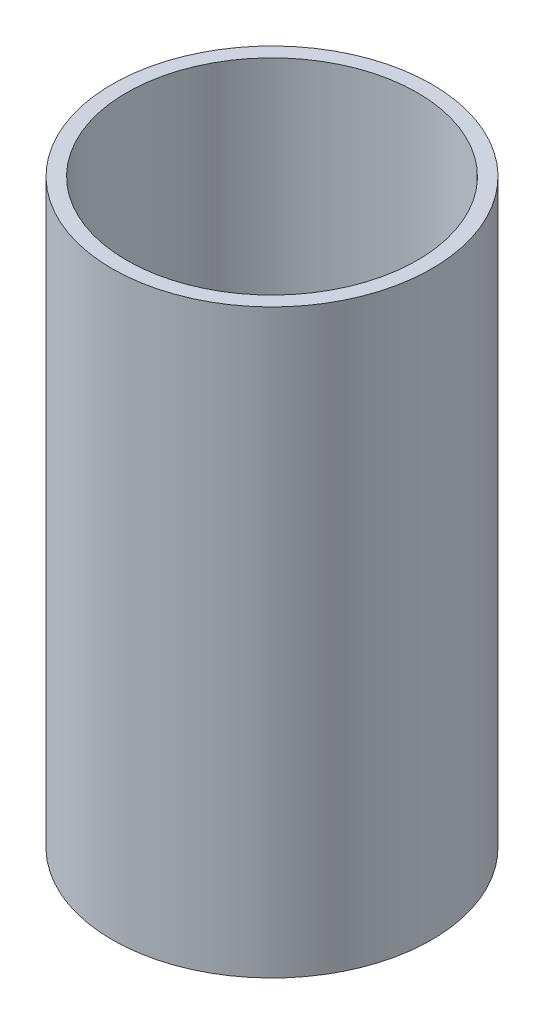
ISO-10303-21;
HEADER;
FILE_DESCRIPTION(('STEP AP214'),'2;1');
FILE_NAME('part.step','',(''),(''),'','','');
FILE_SCHEMA(('AUTOMOTIVE_DESIGN { 1 0 10303 214 1 1 1 1 }'));
ENDSEC;
DATA;
#1=APPLICATION_CONTEXT('core data for automotive mechanical design processes');
#2=APPLICATION_PROTOCOL_DEFINITION('international standard','automotive_design',2000,#1);
#3=PRODUCT_CONTEXT('',#1,'mechanical');
#4=PRODUCT('Part','Part','',(#3));
#5=PRODUCT_RELATED_PRODUCT_CATEGORY('part','',(#4));
#6=PRODUCT_DEFINITION_FORMATION('','',#4);
#7=PRODUCT_DEFINITION_CONTEXT('part definition',#1,'design');
#8=PRODUCT_DEFINITION('design','',#6,#7);
#9=PRODUCT_DEFINITION_SHAPE('','',#8);
#10=(LENGTH_UNIT() NAMED_UNIT(*) SI_UNIT(.MILLI.,.METRE.));
#11=(NAMED_UNIT(*) PLANE_ANGLE_UNIT() SI_UNIT($,.RADIAN.));
#12=(NAMED_UNIT(*) SI_UNIT($,.STERADIAN.) SOLID_ANGLE_UNIT());
#13=UNCERTAINTY_MEASURE_WITH_UNIT(LENGTH_MEASURE(1.E-05),#10,'distance_accuracy_value','');
#14=(GEOMETRIC_REPRESENTATION_CONTEXT(3) GLOBAL_UNCERTAINTY_ASSIGNED_CONTEXT((#13)) GLOBAL_UNIT_ASSIGNED_CONTEXT((#10,
#11,#12)) REPRESENTATION_CONTEXT('',''));
#15=CARTESIAN_POINT('',(0.,0.,0.));
#16=DIRECTION('',(0.,0.,1.));
#17=DIRECTION('',(1.,0.,0.));
#18=AXIS2_PLACEMENT_3D('',#15,#16,#17);
#19=CARTESIAN_POINT('',(0.,120.,0.));
#20=DIRECTION('',(0.,1.,0.));
#21=DIRECTION('',(0.,0.,1.));
#22=AXIS2_PLACEMENT_3D('',#19,#20,#21);
#23=PLANE('',#22);
#24=CARTESIAN_POINT('',(0.,120.,0.));
#25=DIRECTION('',(0.,1.,0.));
#26=DIRECTION('',(0.,0.,1.));
#27=AXIS2_PLACEMENT_3D('',#24,#25,#26);
#28=CIRCLE('',#27,33.);
#29=CARTESIAN_POINT('',(0.,120.,33.));
#30=VERTEX_POINT('',#29);
#31=EDGE_CURVE('E10',#30,#30,#28,.T.);
#32=ORIENTED_EDGE('',*,*,#31,.T.);
#33=EDGE_LOOP('',(#32));
#34=FACE_BOUND('',#33,.T.);
#35=CARTESIAN_POINT('',(0.,120.,0.));
#36=DIRECTION('',(0.,1.,0.));
#37=DIRECTION('',(0.,0.,1.));
#38=AXIS2_PLACEMENT_3D('',#35,#36,#37);
#39=CIRCLE('',#38,30.);
#40=CARTESIAN_POINT('',(0.,120.,30.));
#41=VERTEX_POINT('',#40);
#42=EDGE_CURVE('E50',#41,#41,#39,.T.);
#43=ORIENTED_EDGE('',*,*,#42,.F.);
#44=EDGE_LOOP('',(#43));
#45=FACE_BOUND('',#44,.T.);
#46=ADVANCED_FACE('F37',(#34,#45),#23,.T.);
#47=CARTESIAN_POINT('',(0.,0.,0.));
#48=DIRECTION('',(0.,1.,0.));
#49=DIRECTION('',(0.,0.,1.));
#50=AXIS2_PLACEMENT_3D('',#47,#48,#49);
#51=PLANE('',#50);
#52=CARTESIAN_POINT('',(0.,0.,0.));
#53=DIRECTION('',(0.,1.,0.));
#54=DIRECTION('',(0.,0.,1.));
#55=AXIS2_PLACEMENT_3D('',#52,#53,#54);
#56=CIRCLE('',#55,33.);
#57=CARTESIAN_POINT('',(0.,0.,33.));
#58=VERTEX_POINT('',#57);
#59=EDGE_CURVE('E41',#58,#58,#56,.T.);
#60=ORIENTED_EDGE('',*,*,#59,.F.);
#61=EDGE_LOOP('',(#60));
#62=FACE_BOUND('',#61,.T.);
#63=CARTESIAN_POINT('',(0.,0.,0.));
#64=DIRECTION('',(0.,1.,0.));
#65=DIRECTION('',(0.,0.,1.));
#66=AXIS2_PLACEMENT_3D('',#63,#64,#65);
#67=CIRCLE('',#66,30.);
#68=CARTESIAN_POINT('',(0.,0.,30.));
#69=VERTEX_POINT('',#68);
#70=EDGE_CURVE('E52',#69,#69,#67,.T.);
#71=ORIENTED_EDGE('',*,*,#70,.T.);
#72=EDGE_LOOP('',(#71));
#73=FACE_BOUND('',#72,.T.);
#74=ADVANCED_FACE('F64',(#62,#73),#51,.F.);
#75=CARTESIAN_POINT('',(0.,120.,0.));
#76=DIRECTION('',(0.,-1.,0.));
#77=DIRECTION('',(0.,0.,-1.));
#78=AXIS2_PLACEMENT_3D('',#75,#76,#77);
#79=CYLINDRICAL_SURFACE('',#78,33.);
#80=ORIENTED_EDGE('',*,*,#31,.F.);
#81=EDGE_LOOP('',(#80));
#82=FACE_BOUND('',#81,.T.);
#83=ORIENTED_EDGE('',*,*,#59,.T.);
#84=EDGE_LOOP('',(#83));
#85=FACE_BOUND('',#84,.T.);
#86=ADVANCED_FACE('F39',(#82,#85),#79,.T.);
#87=CARTESIAN_POINT('',(0.,120.,0.));
#88=DIRECTION('',(0.,-1.,0.));
#89=DIRECTION('',(0.,0.,-1.));
#90=AXIS2_PLACEMENT_3D('',#87,#88,#89);
#91=CYLINDRICAL_SURFACE('',#90,30.);
#92=ORIENTED_EDGE('',*,*,#42,.T.);
#93=EDGE_LOOP('',(#92));
#94=FACE_BOUND('',#93,.T.);
#95=ORIENTED_EDGE('',*,*,#70,.F.);
#96=EDGE_LOOP('',(#95));
#97=FACE_BOUND('',#96,.T.);
#98=ADVANCED_FACE('F60',(#94,#97),#91,.F.);
#99=CLOSED_SHELL('',(#46,#74,#86,#98));
#100=MANIFOLD_SOLID_BREP('B2',#99);
#101=ADVANCED_BREP_SHAPE_REPRESENTATION('',(#18,#100),#14);
#102=SHAPE_DEFINITION_REPRESENTATION(#9,#101);
ENDSEC;
END-ISO-10303-21;
